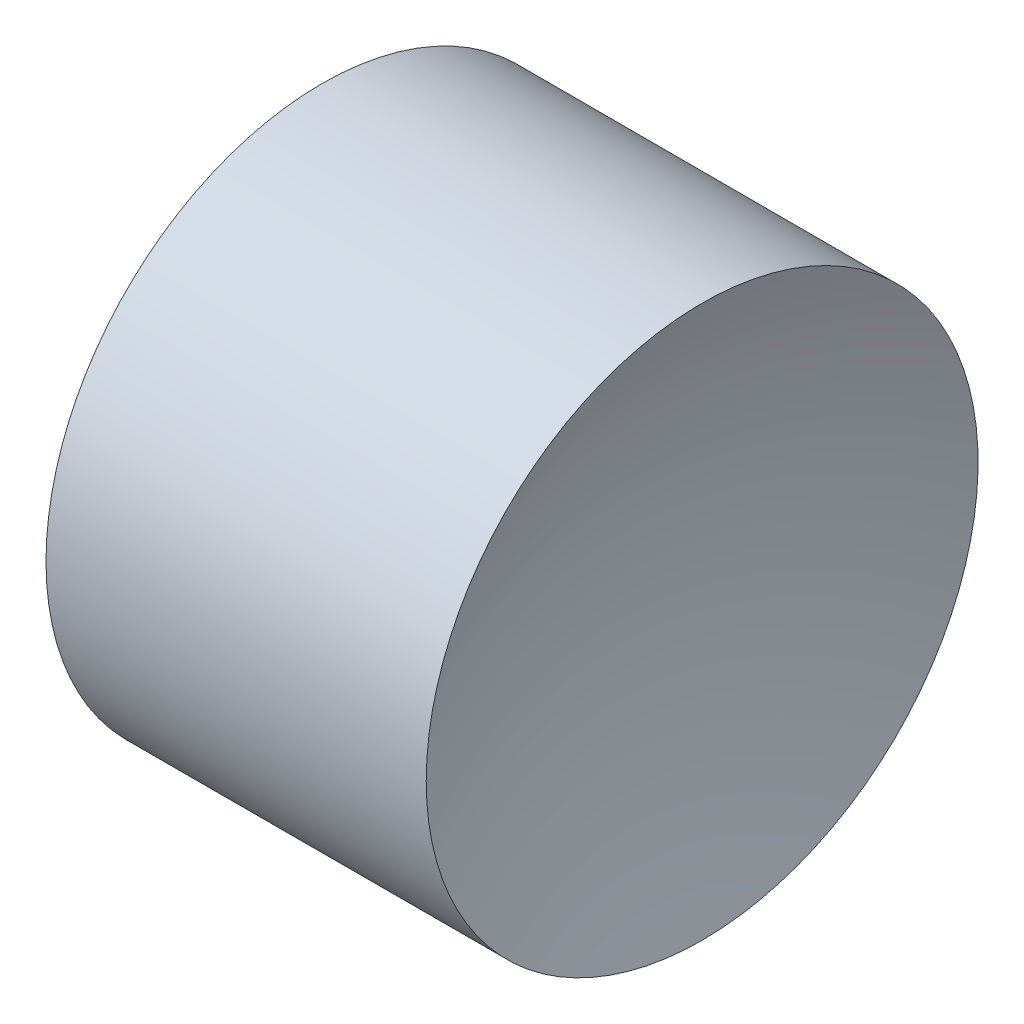
ISO-10303-21;
HEADER;
FILE_DESCRIPTION(('STEP AP214'),'2;1');
FILE_NAME('part.step','',(''),(''),'','','');
FILE_SCHEMA(('AUTOMOTIVE_DESIGN { 1 0 10303 214 1 1 1 1 }'));
ENDSEC;
DATA;
#1=APPLICATION_CONTEXT('core data for automotive mechanical design processes');
#2=APPLICATION_PROTOCOL_DEFINITION('international standard','automotive_design',2000,#1);
#3=PRODUCT_CONTEXT('',#1,'mechanical');
#4=PRODUCT('Part','Part','',(#3));
#5=PRODUCT_RELATED_PRODUCT_CATEGORY('part','',(#4));
#6=PRODUCT_DEFINITION_FORMATION('','',#4);
#7=PRODUCT_DEFINITION_CONTEXT('part definition',#1,'design');
#8=PRODUCT_DEFINITION('design','',#6,#7);
#9=PRODUCT_DEFINITION_SHAPE('','',#8);
#10=(LENGTH_UNIT() NAMED_UNIT(*) SI_UNIT(.MILLI.,.METRE.));
#11=(NAMED_UNIT(*) PLANE_ANGLE_UNIT() SI_UNIT($,.RADIAN.));
#12=(NAMED_UNIT(*) SI_UNIT($,.STERADIAN.) SOLID_ANGLE_UNIT());
#13=UNCERTAINTY_MEASURE_WITH_UNIT(LENGTH_MEASURE(1.E-05),#10,'distance_accuracy_value','');
#14=(GEOMETRIC_REPRESENTATION_CONTEXT(3) GLOBAL_UNCERTAINTY_ASSIGNED_CONTEXT((#13)) GLOBAL_UNIT_ASSIGNED_CONTEXT((#10,
#11,#12)) REPRESENTATION_CONTEXT('',''));
#15=CARTESIAN_POINT('',(0.,0.,0.));
#16=DIRECTION('',(0.,0.,1.));
#17=DIRECTION('',(1.,0.,0.));
#18=AXIS2_PLACEMENT_3D('',#15,#16,#17);
#19=CARTESIAN_POINT('',(2.74961326874907,3.26113014364937,0.));
#20=DIRECTION('',(-1.,0.,0.));
#21=DIRECTION('',(0.,1.,0.));
#22=AXIS2_PLACEMENT_3D('',#19,#20,#21);
#23=SPHERICAL_SURFACE('',#22,2.74);
#24=CARTESIAN_POINT('',(5.30061307274749,3.26113014364937,0.));
#25=DIRECTION('',(-1.,0.,0.));
#26=DIRECTION('',(0.,0.,1.));
#27=AXIS2_PLACEMENT_3D('',#24,#25,#26);
#28=CIRCLE('',#27,1.);
#29=CARTESIAN_POINT('',(5.30061307274749,3.26113014364937,1.));
#30=VERTEX_POINT('',#29);
#31=EDGE_CURVE('E41',#30,#30,#28,.T.);
#32=ORIENTED_EDGE('',*,*,#31,.T.);
#33=EDGE_LOOP('',(#32));
#34=FACE_BOUND('',#33,.T.);
#35=ADVANCED_FACE('F35',(#34),#23,.F.);
#36=CARTESIAN_POINT('',(9.22961326874907,3.26113014364937,0.));
#37=DIRECTION('',(-1.,0.,0.));
#38=DIRECTION('',(0.,-1.,0.));
#39=AXIS2_PLACEMENT_3D('',#36,#37,#38);
#40=SPHERICAL_SURFACE('',#39,2.74);
#41=CARTESIAN_POINT('',(6.67861346475065,3.26113014364937,0.));
#42=DIRECTION('',(-1.,0.,0.));
#43=DIRECTION('',(0.,0.,1.));
#44=AXIS2_PLACEMENT_3D('',#41,#42,#43);
#45=CIRCLE('',#44,1.);
#46=CARTESIAN_POINT('',(6.67861346475065,3.26113014364937,1.));
#47=VERTEX_POINT('',#46);
#48=EDGE_CURVE('E10',#47,#47,#45,.T.);
#49=ORIENTED_EDGE('',*,*,#48,.F.);
#50=EDGE_LOOP('',(#49));
#51=FACE_BOUND('',#50,.T.);
#52=ADVANCED_FACE('F50',(#51),#40,.F.);
#53=CARTESIAN_POINT('',(5.3062326392671,3.26113014364937,0.));
#54=DIRECTION('',(-1.,0.,0.));
#55=DIRECTION('',(0.,0.,1.));
#56=AXIS2_PLACEMENT_3D('',#53,#54,#55);
#57=CYLINDRICAL_SURFACE('',#56,1.);
#58=ORIENTED_EDGE('',*,*,#31,.F.);
#59=EDGE_LOOP('',(#58));
#60=FACE_BOUND('',#59,.T.);
#61=ORIENTED_EDGE('',*,*,#48,.T.);
#62=EDGE_LOOP('',(#61));
#63=FACE_BOUND('',#62,.T.);
#64=ADVANCED_FACE('F48',(#60,#63),#57,.T.);
#65=CLOSED_SHELL('',(#35,#52,#64));
#66=MANIFOLD_SOLID_BREP('B2',#65);
#67=ADVANCED_BREP_SHAPE_REPRESENTATION('',(#18,#66),#14);
#68=SHAPE_DEFINITION_REPRESENTATION(#9,#67);
ENDSEC;
END-ISO-10303-21;
